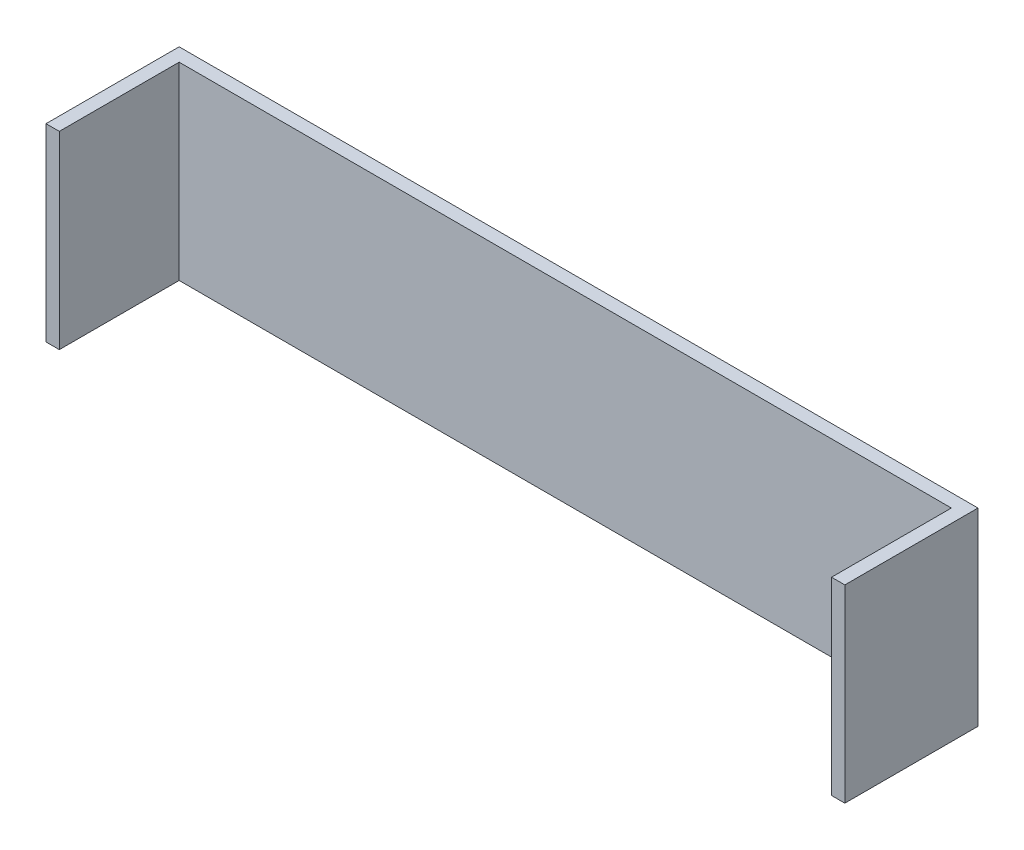
ISO-10303-21;
HEADER;
FILE_DESCRIPTION(('STEP AP214'),'2;1');
FILE_NAME('part.step','',(''),(''),'','','');
FILE_SCHEMA(('AUTOMOTIVE_DESIGN { 1 0 10303 214 1 1 1 1 }'));
ENDSEC;
DATA;
#1=APPLICATION_CONTEXT('core data for automotive mechanical design processes');
#2=APPLICATION_PROTOCOL_DEFINITION('international standard','automotive_design',2000,#1);
#3=PRODUCT_CONTEXT('',#1,'mechanical');
#4=PRODUCT('Part','Part','',(#3));
#5=PRODUCT_RELATED_PRODUCT_CATEGORY('part','',(#4));
#6=PRODUCT_DEFINITION_FORMATION('','',#4);
#7=PRODUCT_DEFINITION_CONTEXT('part definition',#1,'design');
#8=PRODUCT_DEFINITION('design','',#6,#7);
#9=PRODUCT_DEFINITION_SHAPE('','',#8);
#10=(LENGTH_UNIT() NAMED_UNIT(*) SI_UNIT(.MILLI.,.METRE.));
#11=(NAMED_UNIT(*) PLANE_ANGLE_UNIT() SI_UNIT($,.RADIAN.));
#12=(NAMED_UNIT(*) SI_UNIT($,.STERADIAN.) SOLID_ANGLE_UNIT());
#13=UNCERTAINTY_MEASURE_WITH_UNIT(LENGTH_MEASURE(1.E-05),#10,'distance_accuracy_value','');
#14=(GEOMETRIC_REPRESENTATION_CONTEXT(3) GLOBAL_UNCERTAINTY_ASSIGNED_CONTEXT((#13)) GLOBAL_UNIT_ASSIGNED_CONTEXT((#10,
#11,#12)) REPRESENTATION_CONTEXT('',''));
#15=CARTESIAN_POINT('',(0.,0.,0.));
#16=DIRECTION('',(0.,0.,1.));
#17=DIRECTION('',(1.,0.,0.));
#18=AXIS2_PLACEMENT_3D('',#15,#16,#17);
#19=CARTESIAN_POINT('',(184.15,45.085,0.));
#20=DIRECTION('',(1.,0.,0.));
#21=DIRECTION('',(0.,0.,-1.));
#22=AXIS2_PLACEMENT_3D('',#19,#20,#21);
#23=PLANE('',#22);
#24=DIRECTION('',(0.,0.,1.));
#25=VECTOR('',#24,1.);
#26=CARTESIAN_POINT('',(184.15,-45.085,0.));
#27=LINE('',#26,#25);
#28=CARTESIAN_POINT('',(184.15,-45.085,6.34999999999993));
#29=VERTEX_POINT('',#28);
#30=CARTESIAN_POINT('',(184.15,-45.085,63.4999999999999));
#31=VERTEX_POINT('',#30);
#32=EDGE_CURVE('E141',#29,#31,#27,.T.);
#33=ORIENTED_EDGE('',*,*,#32,.T.);
#34=DIRECTION('',(0.,-1.,0.));
#35=VECTOR('',#34,1.);
#36=CARTESIAN_POINT('',(184.15,45.085,63.4999999999999));
#37=LINE('',#36,#35);
#38=CARTESIAN_POINT('',(184.15,45.085,63.4999999999999));
#39=VERTEX_POINT('',#38);
#40=EDGE_CURVE('E11',#39,#31,#37,.T.);
#41=ORIENTED_EDGE('',*,*,#40,.F.);
#42=DIRECTION('',(0.,0.,1.));
#43=VECTOR('',#42,1.);
#44=CARTESIAN_POINT('',(184.15,45.085,0.));
#45=LINE('',#44,#43);
#46=CARTESIAN_POINT('',(184.15,45.085,6.34999999999993));
#47=VERTEX_POINT('',#46);
#48=EDGE_CURVE('E94',#47,#39,#45,.T.);
#49=ORIENTED_EDGE('',*,*,#48,.F.);
#50=DIRECTION('',(0.,-1.,0.));
#51=VECTOR('',#50,1.);
#52=CARTESIAN_POINT('',(184.15,45.085,6.34999999999993));
#53=LINE('',#52,#51);
#54=EDGE_CURVE('E140',#47,#29,#53,.T.);
#55=ORIENTED_EDGE('',*,*,#54,.T.);
#56=EDGE_LOOP('',(#33,#41,#49,#55));
#57=FACE_BOUND('',#56,.T.);
#58=ADVANCED_FACE('F38',(#57),#23,.F.);
#59=CARTESIAN_POINT('',(190.5,45.085,63.4999999999999));
#60=DIRECTION('',(0.,0.,1.));
#61=DIRECTION('',(1.,0.,0.));
#62=AXIS2_PLACEMENT_3D('',#59,#60,#61);
#63=PLANE('',#62);
#64=DIRECTION('',(-1.,0.,0.));
#65=VECTOR('',#64,1.);
#66=CARTESIAN_POINT('',(190.5,-45.085,63.4999999999999));
#67=LINE('',#66,#65);
#68=CARTESIAN_POINT('',(190.5,-45.085,63.4999999999999));
#69=VERTEX_POINT('',#68);
#70=EDGE_CURVE('E145',#69,#31,#67,.T.);
#71=ORIENTED_EDGE('',*,*,#70,.F.);
#72=DIRECTION('',(0.,-1.,0.));
#73=VECTOR('',#72,1.);
#74=CARTESIAN_POINT('',(190.5,45.085,63.4999999999999));
#75=LINE('',#74,#73);
#76=CARTESIAN_POINT('',(190.5,45.085,63.4999999999999));
#77=VERTEX_POINT('',#76);
#78=EDGE_CURVE('E47',#77,#69,#75,.T.);
#79=ORIENTED_EDGE('',*,*,#78,.F.);
#80=DIRECTION('',(-1.,0.,0.));
#81=VECTOR('',#80,1.);
#82=CARTESIAN_POINT('',(190.5,45.085,63.4999999999999));
#83=LINE('',#82,#81);
#84=EDGE_CURVE('E197',#77,#39,#83,.T.);
#85=ORIENTED_EDGE('',*,*,#84,.T.);
#86=ORIENTED_EDGE('',*,*,#40,.T.);
#87=EDGE_LOOP('',(#71,#79,#85,#86));
#88=FACE_BOUND('',#87,.T.);
#89=ADVANCED_FACE('F188',(#88),#63,.T.);
#90=CARTESIAN_POINT('',(190.5,45.085,0.));
#91=DIRECTION('',(1.,0.,0.));
#92=DIRECTION('',(0.,0.,-1.));
#93=AXIS2_PLACEMENT_3D('',#90,#91,#92);
#94=PLANE('',#93);
#95=DIRECTION('',(0.,0.,1.));
#96=VECTOR('',#95,1.);
#97=CARTESIAN_POINT('',(190.5,-45.085,0.));
#98=LINE('',#97,#96);
#99=CARTESIAN_POINT('',(190.5,-45.085,0.));
#100=VERTEX_POINT('',#99);
#101=EDGE_CURVE('E149',#100,#69,#98,.T.);
#102=ORIENTED_EDGE('',*,*,#101,.F.);
#103=DIRECTION('',(0.,-1.,0.));
#104=VECTOR('',#103,1.);
#105=CARTESIAN_POINT('',(190.5,45.085,0.));
#106=LINE('',#105,#104);
#107=CARTESIAN_POINT('',(190.5,45.085,0.));
#108=VERTEX_POINT('',#107);
#109=EDGE_CURVE('E176',#108,#100,#106,.T.);
#110=ORIENTED_EDGE('',*,*,#109,.F.);
#111=DIRECTION('',(0.,0.,1.));
#112=VECTOR('',#111,1.);
#113=CARTESIAN_POINT('',(190.5,45.085,0.));
#114=LINE('',#113,#112);
#115=EDGE_CURVE('E185',#108,#77,#114,.T.);
#116=ORIENTED_EDGE('',*,*,#115,.T.);
#117=ORIENTED_EDGE('',*,*,#78,.T.);
#118=EDGE_LOOP('',(#102,#110,#116,#117));
#119=FACE_BOUND('',#118,.T.);
#120=ADVANCED_FACE('F183',(#119),#94,.T.);
#121=CARTESIAN_POINT('',(-190.5,45.085,0.));
#122=DIRECTION('',(0.,0.,-1.));
#123=DIRECTION('',(-1.,0.,0.));
#124=AXIS2_PLACEMENT_3D('',#121,#122,#123);
#125=PLANE('',#124);
#126=DIRECTION('',(1.,0.,0.));
#127=VECTOR('',#126,1.);
#128=CARTESIAN_POINT('',(-190.5,-45.085,0.));
#129=LINE('',#128,#127);
#130=CARTESIAN_POINT('',(-190.5,-45.085,0.));
#131=VERTEX_POINT('',#130);
#132=EDGE_CURVE('E153',#131,#100,#129,.T.);
#133=ORIENTED_EDGE('',*,*,#132,.F.);
#134=DIRECTION('',(0.,-1.,0.));
#135=VECTOR('',#134,1.);
#136=CARTESIAN_POINT('',(-190.5,45.085,0.));
#137=LINE('',#136,#135);
#138=CARTESIAN_POINT('',(-190.5,45.085,0.));
#139=VERTEX_POINT('',#138);
#140=EDGE_CURVE('E173',#139,#131,#137,.T.);
#141=ORIENTED_EDGE('',*,*,#140,.F.);
#142=DIRECTION('',(1.,0.,0.));
#143=VECTOR('',#142,1.);
#144=CARTESIAN_POINT('',(-190.5,45.085,0.));
#145=LINE('',#144,#143);
#146=EDGE_CURVE('E134',#139,#108,#145,.T.);
#147=ORIENTED_EDGE('',*,*,#146,.T.);
#148=ORIENTED_EDGE('',*,*,#109,.T.);
#149=EDGE_LOOP('',(#133,#141,#147,#148));
#150=FACE_BOUND('',#149,.T.);
#151=ADVANCED_FACE('F195',(#150),#125,.T.);
#152=CARTESIAN_POINT('',(-190.5,45.085,0.));
#153=DIRECTION('',(-1.,0.,0.));
#154=DIRECTION('',(0.,0.,1.));
#155=AXIS2_PLACEMENT_3D('',#152,#153,#154);
#156=PLANE('',#155);
#157=DIRECTION('',(0.,0.,-1.));
#158=VECTOR('',#157,1.);
#159=CARTESIAN_POINT('',(-190.5,-45.085,0.));
#160=LINE('',#159,#158);
#161=CARTESIAN_POINT('',(-190.5,-45.085,63.5));
#162=VERTEX_POINT('',#161);
#163=EDGE_CURVE('E157',#162,#131,#160,.T.);
#164=ORIENTED_EDGE('',*,*,#163,.F.);
#165=DIRECTION('',(0.,-1.,0.));
#166=VECTOR('',#165,1.);
#167=CARTESIAN_POINT('',(-190.5,45.085,63.5));
#168=LINE('',#167,#166);
#169=CARTESIAN_POINT('',(-190.5,45.085,63.5));
#170=VERTEX_POINT('',#169);
#171=EDGE_CURVE('E119',#170,#162,#168,.T.);
#172=ORIENTED_EDGE('',*,*,#171,.F.);
#173=DIRECTION('',(0.,0.,-1.));
#174=VECTOR('',#173,1.);
#175=CARTESIAN_POINT('',(-190.5,45.085,0.));
#176=LINE('',#175,#174);
#177=EDGE_CURVE('E130',#170,#139,#176,.T.);
#178=ORIENTED_EDGE('',*,*,#177,.T.);
#179=ORIENTED_EDGE('',*,*,#140,.T.);
#180=EDGE_LOOP('',(#164,#172,#178,#179));
#181=FACE_BOUND('',#180,.T.);
#182=ADVANCED_FACE('F206',(#181),#156,.T.);
#183=CARTESIAN_POINT('',(-184.15,45.085,63.5));
#184=DIRECTION('',(0.,0.,1.));
#185=DIRECTION('',(1.,0.,0.));
#186=AXIS2_PLACEMENT_3D('',#183,#184,#185);
#187=PLANE('',#186);
#188=DIRECTION('',(-1.,0.,0.));
#189=VECTOR('',#188,1.);
#190=CARTESIAN_POINT('',(-184.15,-45.085,63.5));
#191=LINE('',#190,#189);
#192=CARTESIAN_POINT('',(-184.15,-45.085,63.5));
#193=VERTEX_POINT('',#192);
#194=EDGE_CURVE('E117',#193,#162,#191,.T.);
#195=ORIENTED_EDGE('',*,*,#194,.F.);
#196=DIRECTION('',(0.,-1.,0.));
#197=VECTOR('',#196,1.);
#198=CARTESIAN_POINT('',(-184.15,45.085,63.5));
#199=LINE('',#198,#197);
#200=CARTESIAN_POINT('',(-184.15,45.085,63.5));
#201=VERTEX_POINT('',#200);
#202=EDGE_CURVE('E111',#201,#193,#199,.T.);
#203=ORIENTED_EDGE('',*,*,#202,.F.);
#204=DIRECTION('',(-1.,0.,0.));
#205=VECTOR('',#204,1.);
#206=CARTESIAN_POINT('',(-184.15,45.085,63.5));
#207=LINE('',#206,#205);
#208=EDGE_CURVE('E115',#201,#170,#207,.T.);
#209=ORIENTED_EDGE('',*,*,#208,.T.);
#210=ORIENTED_EDGE('',*,*,#171,.T.);
#211=EDGE_LOOP('',(#195,#203,#209,#210));
#212=FACE_BOUND('',#211,.T.);
#213=ADVANCED_FACE('F113',(#212),#187,.T.);
#214=CARTESIAN_POINT('',(-184.15,45.085,0.));
#215=DIRECTION('',(-1.,0.,0.));
#216=DIRECTION('',(0.,0.,1.));
#217=AXIS2_PLACEMENT_3D('',#214,#215,#216);
#218=PLANE('',#217);
#219=DIRECTION('',(0.,0.,-1.));
#220=VECTOR('',#219,1.);
#221=CARTESIAN_POINT('',(-184.15,-45.085,0.));
#222=LINE('',#221,#220);
#223=CARTESIAN_POINT('',(-184.15,-45.085,6.35));
#224=VERTEX_POINT('',#223);
#225=EDGE_CURVE('E82',#193,#224,#222,.T.);
#226=ORIENTED_EDGE('',*,*,#225,.T.);
#227=DIRECTION('',(0.,-1.,0.));
#228=VECTOR('',#227,1.);
#229=CARTESIAN_POINT('',(-184.15,45.085,6.35));
#230=LINE('',#229,#228);
#231=CARTESIAN_POINT('',(-184.15,45.085,6.35));
#232=VERTEX_POINT('',#231);
#233=EDGE_CURVE('E120',#232,#224,#230,.T.);
#234=ORIENTED_EDGE('',*,*,#233,.F.);
#235=DIRECTION('',(0.,0.,-1.));
#236=VECTOR('',#235,1.);
#237=CARTESIAN_POINT('',(-184.15,45.085,0.));
#238=LINE('',#237,#236);
#239=EDGE_CURVE('E122',#201,#232,#238,.T.);
#240=ORIENTED_EDGE('',*,*,#239,.F.);
#241=ORIENTED_EDGE('',*,*,#202,.T.);
#242=EDGE_LOOP('',(#226,#234,#240,#241));
#243=FACE_BOUND('',#242,.T.);
#244=ADVANCED_FACE('F123',(#243),#218,.F.);
#245=CARTESIAN_POINT('',(-190.5,45.085,6.35));
#246=DIRECTION('',(0.,0.,-1.));
#247=DIRECTION('',(-1.,0.,0.));
#248=AXIS2_PLACEMENT_3D('',#245,#246,#247);
#249=PLANE('',#248);
#250=DIRECTION('',(1.,0.,0.));
#251=VECTOR('',#250,1.);
#252=CARTESIAN_POINT('',(-190.5,-45.085,6.35));
#253=LINE('',#252,#251);
#254=EDGE_CURVE('E88',#224,#29,#253,.T.);
#255=ORIENTED_EDGE('',*,*,#254,.T.);
#256=ORIENTED_EDGE('',*,*,#54,.F.);
#257=DIRECTION('',(1.,0.,0.));
#258=VECTOR('',#257,1.);
#259=CARTESIAN_POINT('',(-190.5,45.085,6.35));
#260=LINE('',#259,#258);
#261=EDGE_CURVE('E55',#232,#47,#260,.T.);
#262=ORIENTED_EDGE('',*,*,#261,.F.);
#263=ORIENTED_EDGE('',*,*,#233,.T.);
#264=EDGE_LOOP('',(#255,#256,#262,#263));
#265=FACE_BOUND('',#264,.T.);
#266=ADVANCED_FACE('F208',(#265),#249,.F.);
#267=CARTESIAN_POINT('',(0.,45.085,0.));
#268=DIRECTION('',(0.,-1.,0.));
#269=DIRECTION('',(-1.,0.,0.));
#270=AXIS2_PLACEMENT_3D('',#267,#268,#269);
#271=PLANE('',#270);
#272=ORIENTED_EDGE('',*,*,#48,.T.);
#273=ORIENTED_EDGE('',*,*,#84,.F.);
#274=ORIENTED_EDGE('',*,*,#115,.F.);
#275=ORIENTED_EDGE('',*,*,#146,.F.);
#276=ORIENTED_EDGE('',*,*,#177,.F.);
#277=ORIENTED_EDGE('',*,*,#208,.F.);
#278=ORIENTED_EDGE('',*,*,#239,.T.);
#279=ORIENTED_EDGE('',*,*,#261,.T.);
#280=EDGE_LOOP('',(#272,#273,#274,#275,#276,#277,#278,#279));
#281=FACE_BOUND('',#280,.T.);
#282=ADVANCED_FACE('F127',(#281),#271,.F.);
#283=CARTESIAN_POINT('',(0.,-45.085,0.));
#284=DIRECTION('',(0.,-1.,0.));
#285=DIRECTION('',(-1.,0.,0.));
#286=AXIS2_PLACEMENT_3D('',#283,#284,#285);
#287=PLANE('',#286);
#288=ORIENTED_EDGE('',*,*,#32,.F.);
#289=ORIENTED_EDGE('',*,*,#254,.F.);
#290=ORIENTED_EDGE('',*,*,#225,.F.);
#291=ORIENTED_EDGE('',*,*,#194,.T.);
#292=ORIENTED_EDGE('',*,*,#163,.T.);
#293=ORIENTED_EDGE('',*,*,#132,.T.);
#294=ORIENTED_EDGE('',*,*,#101,.T.);
#295=ORIENTED_EDGE('',*,*,#70,.T.);
#296=EDGE_LOOP('',(#288,#289,#290,#291,#292,#293,#294,#295));
#297=FACE_BOUND('',#296,.T.);
#298=ADVANCED_FACE('F191',(#297),#287,.T.);
#299=CLOSED_SHELL('',(#58,#89,#120,#151,#182,#213,#244,#266,#282,#298));
#300=MANIFOLD_SOLID_BREP('B2',#299);
#301=ADVANCED_BREP_SHAPE_REPRESENTATION('',(#18,#300),#14);
#302=SHAPE_DEFINITION_REPRESENTATION(#9,#301);
ENDSEC;
END-ISO-10303-21;
